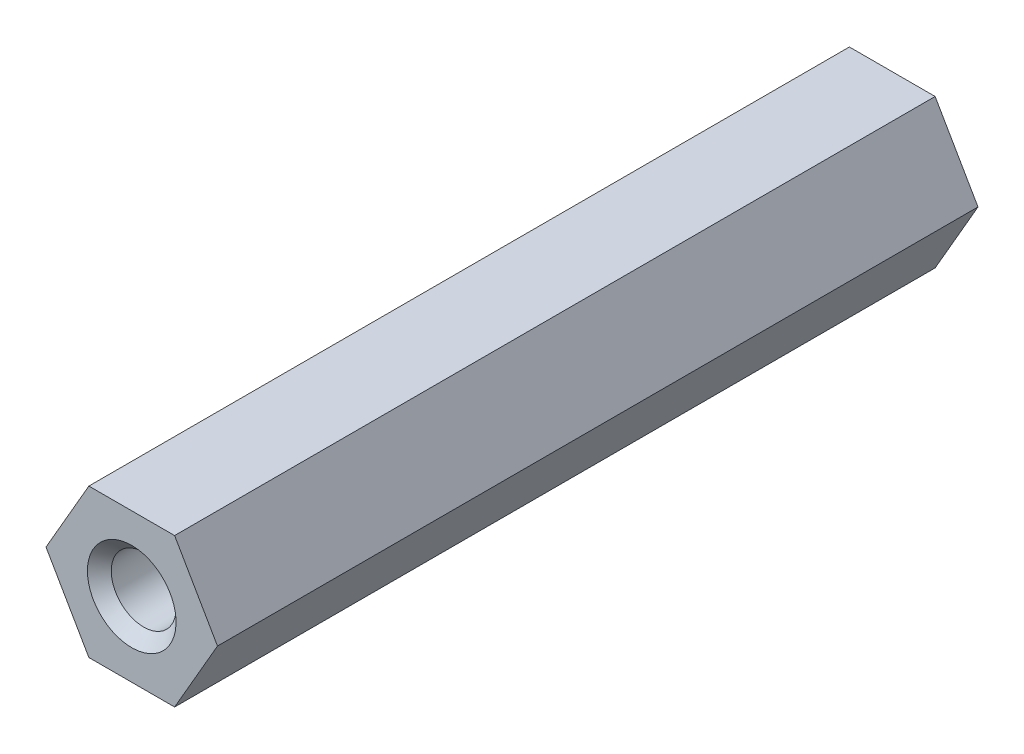
ISO-10303-21;
HEADER;
FILE_DESCRIPTION(('STEP AP214'),'2;1');
FILE_NAME('part.step','',(''),(''),'','','');
FILE_SCHEMA(('AUTOMOTIVE_DESIGN { 1 0 10303 214 1 1 1 1 }'));
ENDSEC;
DATA;
#1=APPLICATION_CONTEXT('core data for automotive mechanical design processes');
#2=APPLICATION_PROTOCOL_DEFINITION('international standard','automotive_design',2000,#1);
#3=PRODUCT_CONTEXT('',#1,'mechanical');
#4=PRODUCT('Part','Part','',(#3));
#5=PRODUCT_RELATED_PRODUCT_CATEGORY('part','',(#4));
#6=PRODUCT_DEFINITION_FORMATION('','',#4);
#7=PRODUCT_DEFINITION_CONTEXT('part definition',#1,'design');
#8=PRODUCT_DEFINITION('design','',#6,#7);
#9=PRODUCT_DEFINITION_SHAPE('','',#8);
#10=(LENGTH_UNIT() NAMED_UNIT(*) SI_UNIT(.MILLI.,.METRE.));
#11=(NAMED_UNIT(*) PLANE_ANGLE_UNIT() SI_UNIT($,.RADIAN.));
#12=(NAMED_UNIT(*) SI_UNIT($,.STERADIAN.) SOLID_ANGLE_UNIT());
#13=UNCERTAINTY_MEASURE_WITH_UNIT(LENGTH_MEASURE(1.E-05),#10,'distance_accuracy_value','');
#14=(GEOMETRIC_REPRESENTATION_CONTEXT(3) GLOBAL_UNCERTAINTY_ASSIGNED_CONTEXT((#13)) GLOBAL_UNIT_ASSIGNED_CONTEXT((#10,
#11,#12)) REPRESENTATION_CONTEXT('',''));
#15=CARTESIAN_POINT('',(0.,0.,0.));
#16=DIRECTION('',(0.,0.,1.));
#17=DIRECTION('',(1.,0.,0.));
#18=AXIS2_PLACEMENT_3D('',#15,#16,#17);
#19=CARTESIAN_POINT('',(-1.78978583448784,-3.1,31.75));
#20=DIRECTION('',(0.,1.,0.));
#21=DIRECTION('',(-1.,0.,0.));
#22=AXIS2_PLACEMENT_3D('',#19,#20,#21);
#23=PLANE('',#22);
#24=DIRECTION('',(1.,0.,0.));
#25=VECTOR('',#24,1.);
#26=CARTESIAN_POINT('',(-1.78978583448784,-3.1,0.));
#27=LINE('',#26,#25);
#28=CARTESIAN_POINT('',(-1.78978583448784,-3.1,0.));
#29=VERTEX_POINT('',#28);
#30=CARTESIAN_POINT('',(1.78978583448784,-3.1,0.));
#31=VERTEX_POINT('',#30);
#32=EDGE_CURVE('E119',#29,#31,#27,.T.);
#33=ORIENTED_EDGE('',*,*,#32,.T.);
#34=DIRECTION('',(0.,0.,-1.));
#35=VECTOR('',#34,1.);
#36=CARTESIAN_POINT('',(1.78978583448784,-3.1,31.75));
#37=LINE('',#36,#35);
#38=CARTESIAN_POINT('',(1.78978583448784,-3.1,31.75));
#39=VERTEX_POINT('',#38);
#40=EDGE_CURVE('E11',#39,#31,#37,.T.);
#41=ORIENTED_EDGE('',*,*,#40,.F.);
#42=DIRECTION('',(1.,0.,0.));
#43=VECTOR('',#42,1.);
#44=CARTESIAN_POINT('',(-1.78978583448784,-3.1,31.75));
#45=LINE('',#44,#43);
#46=CARTESIAN_POINT('',(-1.78978583448784,-3.1,31.75));
#47=VERTEX_POINT('',#46);
#48=EDGE_CURVE('E130',#47,#39,#45,.T.);
#49=ORIENTED_EDGE('',*,*,#48,.F.);
#50=DIRECTION('',(0.,0.,-1.));
#51=VECTOR('',#50,1.);
#52=CARTESIAN_POINT('',(-1.78978583448784,-3.1,31.75));
#53=LINE('',#52,#51);
#54=EDGE_CURVE('E115',#47,#29,#53,.T.);
#55=ORIENTED_EDGE('',*,*,#54,.T.);
#56=EDGE_LOOP('',(#33,#41,#49,#55));
#57=FACE_BOUND('',#56,.T.);
#58=ADVANCED_FACE('F35',(#57),#23,.F.);
#59=CARTESIAN_POINT('',(1.78978583448784,-3.1,31.75));
#60=DIRECTION('',(-0.866025403784439,0.5,0.));
#61=DIRECTION('',(-0.5,-0.866025403784439,0.));
#62=AXIS2_PLACEMENT_3D('',#59,#60,#61);
#63=PLANE('',#62);
#64=DIRECTION('',(0.5,0.866025403784439,0.));
#65=VECTOR('',#64,1.);
#66=CARTESIAN_POINT('',(1.78978583448784,-3.1,0.));
#67=LINE('',#66,#65);
#68=CARTESIAN_POINT('',(3.57957166897568,0.,0.));
#69=VERTEX_POINT('',#68);
#70=EDGE_CURVE('E122',#31,#69,#67,.T.);
#71=ORIENTED_EDGE('',*,*,#70,.T.);
#72=DIRECTION('',(0.,0.,-1.));
#73=VECTOR('',#72,1.);
#74=CARTESIAN_POINT('',(3.57957166897568,0.,31.75));
#75=LINE('',#74,#73);
#76=CARTESIAN_POINT('',(3.57957166897568,0.,31.75));
#77=VERTEX_POINT('',#76);
#78=EDGE_CURVE('E43',#77,#69,#75,.T.);
#79=ORIENTED_EDGE('',*,*,#78,.F.);
#80=DIRECTION('',(0.5,0.866025403784439,0.));
#81=VECTOR('',#80,1.);
#82=CARTESIAN_POINT('',(1.78978583448784,-3.1,31.75));
#83=LINE('',#82,#81);
#84=EDGE_CURVE('E88',#39,#77,#83,.T.);
#85=ORIENTED_EDGE('',*,*,#84,.F.);
#86=ORIENTED_EDGE('',*,*,#40,.T.);
#87=EDGE_LOOP('',(#71,#79,#85,#86));
#88=FACE_BOUND('',#87,.T.);
#89=ADVANCED_FACE('F155',(#88),#63,.F.);
#90=CARTESIAN_POINT('',(3.57957166897568,0.,31.75));
#91=DIRECTION('',(-0.866025403784438,-0.5,0.));
#92=DIRECTION('',(0.5,-0.866025403784439,0.));
#93=AXIS2_PLACEMENT_3D('',#90,#91,#92);
#94=PLANE('',#93);
#95=DIRECTION('',(-0.5,0.866025403784438,0.));
#96=VECTOR('',#95,1.);
#97=CARTESIAN_POINT('',(3.57957166897568,0.,0.));
#98=LINE('',#97,#96);
#99=CARTESIAN_POINT('',(1.78978583448784,3.1,0.));
#100=VERTEX_POINT('',#99);
#101=EDGE_CURVE('E125',#69,#100,#98,.T.);
#102=ORIENTED_EDGE('',*,*,#101,.T.);
#103=DIRECTION('',(0.,0.,-1.));
#104=VECTOR('',#103,1.);
#105=CARTESIAN_POINT('',(1.78978583448784,3.1,31.75));
#106=LINE('',#105,#104);
#107=CARTESIAN_POINT('',(1.78978583448784,3.1,31.75));
#108=VERTEX_POINT('',#107);
#109=EDGE_CURVE('E110',#108,#100,#106,.T.);
#110=ORIENTED_EDGE('',*,*,#109,.F.);
#111=DIRECTION('',(-0.5,0.866025403784438,0.));
#112=VECTOR('',#111,1.);
#113=CARTESIAN_POINT('',(3.57957166897568,0.,31.75));
#114=LINE('',#113,#112);
#115=EDGE_CURVE('E101',#77,#108,#114,.T.);
#116=ORIENTED_EDGE('',*,*,#115,.F.);
#117=ORIENTED_EDGE('',*,*,#78,.T.);
#118=EDGE_LOOP('',(#102,#110,#116,#117));
#119=FACE_BOUND('',#118,.T.);
#120=ADVANCED_FACE('F136',(#119),#94,.F.);
#121=CARTESIAN_POINT('',(1.78978583448784,3.1,31.75));
#122=DIRECTION('',(0.,-1.,0.));
#123=DIRECTION('',(0.,0.,-1.));
#124=AXIS2_PLACEMENT_3D('',#121,#122,#123);
#125=PLANE('',#124);
#126=DIRECTION('',(-1.,0.,0.));
#127=VECTOR('',#126,1.);
#128=CARTESIAN_POINT('',(1.78978583448784,3.1,0.));
#129=LINE('',#128,#127);
#130=CARTESIAN_POINT('',(-1.78978583448784,3.1,0.));
#131=VERTEX_POINT('',#130);
#132=EDGE_CURVE('E109',#100,#131,#129,.T.);
#133=ORIENTED_EDGE('',*,*,#132,.T.);
#134=DIRECTION('',(0.,0.,-1.));
#135=VECTOR('',#134,1.);
#136=CARTESIAN_POINT('',(-1.78978583448784,3.1,31.75));
#137=LINE('',#136,#135);
#138=CARTESIAN_POINT('',(-1.78978583448784,3.1,31.75));
#139=VERTEX_POINT('',#138);
#140=EDGE_CURVE('E106',#139,#131,#137,.T.);
#141=ORIENTED_EDGE('',*,*,#140,.F.);
#142=DIRECTION('',(-1.,0.,0.));
#143=VECTOR('',#142,1.);
#144=CARTESIAN_POINT('',(1.78978583448784,3.1,31.75));
#145=LINE('',#144,#143);
#146=EDGE_CURVE('E95',#108,#139,#145,.T.);
#147=ORIENTED_EDGE('',*,*,#146,.F.);
#148=ORIENTED_EDGE('',*,*,#109,.T.);
#149=EDGE_LOOP('',(#133,#141,#147,#148));
#150=FACE_BOUND('',#149,.T.);
#151=ADVANCED_FACE('F107',(#150),#125,.F.);
#152=CARTESIAN_POINT('',(-1.78978583448784,3.1,31.75));
#153=DIRECTION('',(0.866025403784439,-0.5,0.));
#154=DIRECTION('',(0.5,0.866025403784439,0.));
#155=AXIS2_PLACEMENT_3D('',#152,#153,#154);
#156=PLANE('',#155);
#157=DIRECTION('',(-0.5,-0.866025403784439,0.));
#158=VECTOR('',#157,1.);
#159=CARTESIAN_POINT('',(-1.78978583448784,3.1,0.));
#160=LINE('',#159,#158);
#161=CARTESIAN_POINT('',(-3.57957166897568,0.,0.));
#162=VERTEX_POINT('',#161);
#163=EDGE_CURVE('E74',#131,#162,#160,.T.);
#164=ORIENTED_EDGE('',*,*,#163,.T.);
#165=DIRECTION('',(0.,0.,-1.));
#166=VECTOR('',#165,1.);
#167=CARTESIAN_POINT('',(-3.57957166897568,0.,31.75));
#168=LINE('',#167,#166);
#169=CARTESIAN_POINT('',(-3.57957166897568,0.,31.75));
#170=VERTEX_POINT('',#169);
#171=EDGE_CURVE('E111',#170,#162,#168,.T.);
#172=ORIENTED_EDGE('',*,*,#171,.F.);
#173=DIRECTION('',(-0.5,-0.866025403784439,0.));
#174=VECTOR('',#173,1.);
#175=CARTESIAN_POINT('',(-1.78978583448784,3.1,31.75));
#176=LINE('',#175,#174);
#177=EDGE_CURVE('E99',#139,#170,#176,.T.);
#178=ORIENTED_EDGE('',*,*,#177,.F.);
#179=ORIENTED_EDGE('',*,*,#140,.T.);
#180=EDGE_LOOP('',(#164,#172,#178,#179));
#181=FACE_BOUND('',#180,.T.);
#182=ADVANCED_FACE('F113',(#181),#156,.F.);
#183=CARTESIAN_POINT('',(-3.57957166897568,0.,31.75));
#184=DIRECTION('',(0.866025403784439,0.5,0.));
#185=DIRECTION('',(-0.5,0.866025403784439,0.));
#186=AXIS2_PLACEMENT_3D('',#183,#184,#185);
#187=PLANE('',#186);
#188=DIRECTION('',(0.5,-0.866025403784439,0.));
#189=VECTOR('',#188,1.);
#190=CARTESIAN_POINT('',(-3.57957166897568,0.,0.));
#191=LINE('',#190,#189);
#192=EDGE_CURVE('E80',#162,#29,#191,.T.);
#193=ORIENTED_EDGE('',*,*,#192,.T.);
#194=ORIENTED_EDGE('',*,*,#54,.F.);
#195=DIRECTION('',(0.5,-0.866025403784439,0.));
#196=VECTOR('',#195,1.);
#197=CARTESIAN_POINT('',(-3.57957166897568,0.,31.75));
#198=LINE('',#197,#196);
#199=EDGE_CURVE('E51',#170,#47,#198,.T.);
#200=ORIENTED_EDGE('',*,*,#199,.F.);
#201=ORIENTED_EDGE('',*,*,#171,.T.);
#202=EDGE_LOOP('',(#193,#194,#200,#201));
#203=FACE_BOUND('',#202,.T.);
#204=ADVANCED_FACE('F143',(#203),#187,.F.);
#205=CARTESIAN_POINT('',(0.,0.,31.75));
#206=DIRECTION('',(0.,0.,1.));
#207=DIRECTION('',(1.,0.,0.));
#208=AXIS2_PLACEMENT_3D('',#205,#206,#207);
#209=PLANE('',#208);
#210=CARTESIAN_POINT('',(0.,0.,31.75));
#211=DIRECTION('',(0.,0.,-1.));
#212=DIRECTION('',(-1.,0.,0.));
#213=AXIS2_PLACEMENT_3D('',#210,#211,#212);
#214=CIRCLE('',#213,1.84999998299999);
#215=CARTESIAN_POINT('',(-1.84999998299999,0.,31.75));
#216=VERTEX_POINT('',#215);
#217=EDGE_CURVE('E232',#216,#216,#214,.T.);
#218=ORIENTED_EDGE('',*,*,#217,.T.);
#219=EDGE_LOOP('',(#218));
#220=FACE_BOUND('',#219,.T.);
#221=ORIENTED_EDGE('',*,*,#48,.T.);
#222=ORIENTED_EDGE('',*,*,#84,.T.);
#223=ORIENTED_EDGE('',*,*,#115,.T.);
#224=ORIENTED_EDGE('',*,*,#146,.T.);
#225=ORIENTED_EDGE('',*,*,#177,.T.);
#226=ORIENTED_EDGE('',*,*,#199,.T.);
#227=EDGE_LOOP('',(#221,#222,#223,#224,#225,#226));
#228=FACE_BOUND('',#227,.T.);
#229=ADVANCED_FACE('F97',(#220,#228),#209,.T.);
#230=CARTESIAN_POINT('',(0.,0.,0.));
#231=DIRECTION('',(0.,0.,1.));
#232=DIRECTION('',(1.,0.,0.));
#233=AXIS2_PLACEMENT_3D('',#230,#231,#232);
#234=PLANE('',#233);
#235=CARTESIAN_POINT('',(0.,0.,0.));
#236=DIRECTION('',(0.,0.,-1.));
#237=DIRECTION('',(-1.,0.,0.));
#238=AXIS2_PLACEMENT_3D('',#235,#236,#237);
#239=CIRCLE('',#238,1.849999983);
#240=CARTESIAN_POINT('',(-1.849999983,0.,0.));
#241=VERTEX_POINT('',#240);
#242=EDGE_CURVE('E231',#241,#241,#239,.T.);
#243=ORIENTED_EDGE('',*,*,#242,.F.);
#244=EDGE_LOOP('',(#243));
#245=FACE_BOUND('',#244,.T.);
#246=ORIENTED_EDGE('',*,*,#32,.F.);
#247=ORIENTED_EDGE('',*,*,#192,.F.);
#248=ORIENTED_EDGE('',*,*,#163,.F.);
#249=ORIENTED_EDGE('',*,*,#132,.F.);
#250=ORIENTED_EDGE('',*,*,#101,.F.);
#251=ORIENTED_EDGE('',*,*,#70,.F.);
#252=EDGE_LOOP('',(#246,#247,#248,#249,#250,#251));
#253=FACE_BOUND('',#252,.T.);
#254=ADVANCED_FACE('F139',(#245,#253),#234,.F.);
#255=CARTESIAN_POINT('',(0.,0.,31.252550017));
#256=DIRECTION('',(0.,0.,1.));
#257=DIRECTION('',(1.,0.,0.));
#258=AXIS2_PLACEMENT_3D('',#255,#256,#257);
#259=CONICAL_SURFACE('',#258,1.35254999999999,0.78539816339745);
#260=ORIENTED_EDGE('',*,*,#217,.F.);
#261=EDGE_LOOP('',(#260));
#262=FACE_BOUND('',#261,.T.);
#263=CARTESIAN_POINT('',(0.,0.,31.252550017));
#264=DIRECTION('',(0.,0.,-1.));
#265=DIRECTION('',(-1.,0.,0.));
#266=AXIS2_PLACEMENT_3D('',#263,#264,#265);
#267=CIRCLE('',#266,1.35254999999999);
#268=CARTESIAN_POINT('',(-1.35254999999999,0.,31.252550017));
#269=VERTEX_POINT('',#268);
#270=EDGE_CURVE('E123',#269,#269,#267,.T.);
#271=ORIENTED_EDGE('',*,*,#270,.T.);
#272=EDGE_LOOP('',(#271));
#273=FACE_BOUND('',#272,.T.);
#274=ADVANCED_FACE('F192',(#262,#273),#259,.F.);
#275=CARTESIAN_POINT('',(0.,0.,0.));
#276=DIRECTION('',(0.,0.,-1.));
#277=DIRECTION('',(-1.,0.,0.));
#278=AXIS2_PLACEMENT_3D('',#275,#276,#277);
#279=CYLINDRICAL_SURFACE('',#278,1.35254999999999);
#280=ORIENTED_EDGE('',*,*,#270,.F.);
#281=EDGE_LOOP('',(#280));
#282=FACE_BOUND('',#281,.T.);
#283=CARTESIAN_POINT('',(0.,0.,0.497449983000001));
#284=DIRECTION('',(0.,0.,-1.));
#285=DIRECTION('',(-1.,0.,0.));
#286=AXIS2_PLACEMENT_3D('',#283,#284,#285);
#287=CIRCLE('',#286,1.35255);
#288=CARTESIAN_POINT('',(-1.35255,0.,0.497449983000001));
#289=VERTEX_POINT('',#288);
#290=EDGE_CURVE('E228',#289,#289,#287,.T.);
#291=ORIENTED_EDGE('',*,*,#290,.T.);
#292=EDGE_LOOP('',(#291));
#293=FACE_BOUND('',#292,.T.);
#294=ADVANCED_FACE('F201',(#282,#293),#279,.F.);
#295=CARTESIAN_POINT('',(0.,0.,0.));
#296=DIRECTION('',(0.,0.,-1.));
#297=DIRECTION('',(-1.,0.,0.));
#298=AXIS2_PLACEMENT_3D('',#295,#296,#297);
#299=CONICAL_SURFACE('',#298,1.849999983,0.785398163397451);
#300=ORIENTED_EDGE('',*,*,#290,.F.);
#301=EDGE_LOOP('',(#300));
#302=FACE_BOUND('',#301,.T.);
#303=ORIENTED_EDGE('',*,*,#242,.T.);
#304=EDGE_LOOP('',(#303));
#305=FACE_BOUND('',#304,.T.);
#306=ADVANCED_FACE('F211',(#302,#305),#299,.F.);
#307=CLOSED_SHELL('',(#58,#89,#120,#151,#182,#204,#229,#254,#274,#294,#306));
#308=MANIFOLD_SOLID_BREP('B2',#307);
#309=ADVANCED_BREP_SHAPE_REPRESENTATION('',(#18,#308),#14);
#310=SHAPE_DEFINITION_REPRESENTATION(#9,#309);
ENDSEC;
END-ISO-10303-21;
